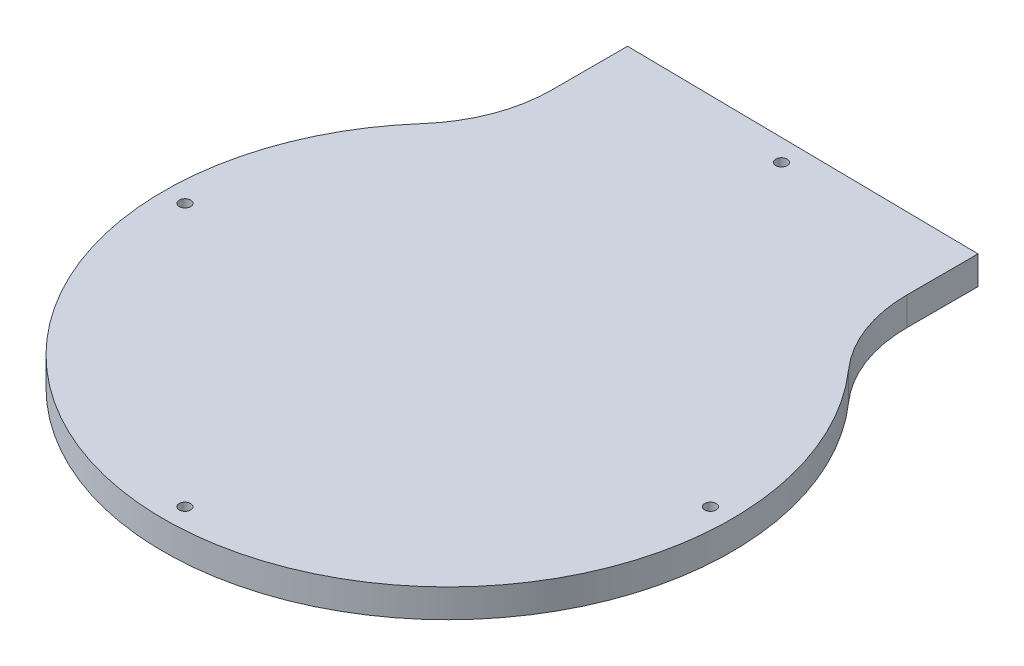
ISO-10303-21;
HEADER;
FILE_DESCRIPTION(('STEP AP214'),'2;1');
FILE_NAME('part.step','',(''),(''),'','','');
FILE_SCHEMA(('AUTOMOTIVE_DESIGN { 1 0 10303 214 1 1 1 1 }'));
ENDSEC;
DATA;
#1=APPLICATION_CONTEXT('core data for automotive mechanical design processes');
#2=APPLICATION_PROTOCOL_DEFINITION('international standard','automotive_design',2000,#1);
#3=PRODUCT_CONTEXT('',#1,'mechanical');
#4=PRODUCT('Part','Part','',(#3));
#5=PRODUCT_RELATED_PRODUCT_CATEGORY('part','',(#4));
#6=PRODUCT_DEFINITION_FORMATION('','',#4);
#7=PRODUCT_DEFINITION_CONTEXT('part definition',#1,'design');
#8=PRODUCT_DEFINITION('design','',#6,#7);
#9=PRODUCT_DEFINITION_SHAPE('','',#8);
#10=(LENGTH_UNIT() NAMED_UNIT(*) SI_UNIT(.MILLI.,.METRE.));
#11=(NAMED_UNIT(*) PLANE_ANGLE_UNIT() SI_UNIT($,.RADIAN.));
#12=(NAMED_UNIT(*) SI_UNIT($,.STERADIAN.) SOLID_ANGLE_UNIT());
#13=UNCERTAINTY_MEASURE_WITH_UNIT(LENGTH_MEASURE(1.E-05),#10,'distance_accuracy_value','');
#14=(GEOMETRIC_REPRESENTATION_CONTEXT(3) GLOBAL_UNCERTAINTY_ASSIGNED_CONTEXT((#13)) GLOBAL_UNIT_ASSIGNED_CONTEXT((#10,
#11,#12)) REPRESENTATION_CONTEXT('',''));
#15=CARTESIAN_POINT('',(0.,0.,0.));
#16=DIRECTION('',(0.,0.,1.));
#17=DIRECTION('',(1.,0.,0.));
#18=AXIS2_PLACEMENT_3D('',#15,#16,#17);
#19=CARTESIAN_POINT('',(44.9979087332291,4.,-39.6886408136634));
#20=DIRECTION('',(0.,-1.,0.));
#21=DIRECTION('',(0.,0.,-1.));
#22=AXIS2_PLACEMENT_3D('',#19,#20,#21);
#23=CYLINDRICAL_SURFACE('',#22,20.);
#24=CARTESIAN_POINT('',(44.9979087332291,0.,-39.6886408136634));
#25=DIRECTION('',(0.,1.,0.));
#26=DIRECTION('',(0.,0.,1.));
#27=AXIS2_PLACEMENT_3D('',#24,#25,#26);
#28=CIRCLE('',#27,20.);
#29=CARTESIAN_POINT('',(24.997908733229,0.,-39.6886408136634));
#30=VERTEX_POINT('',#29);
#31=CARTESIAN_POINT('',(29.9986058221527,0.,-26.4590938757756));
#32=VERTEX_POINT('',#31);
#33=EDGE_CURVE('E118',#30,#32,#28,.T.);
#34=ORIENTED_EDGE('',*,*,#33,.F.);
#35=DIRECTION('',(0.,-1.,0.));
#36=VECTOR('',#35,1.);
#37=CARTESIAN_POINT('',(24.997908733229,4.,-39.6886408136634));
#38=LINE('',#37,#36);
#39=CARTESIAN_POINT('',(24.997908733229,4.,-39.6886408136634));
#40=VERTEX_POINT('',#39);
#41=EDGE_CURVE('E11',#40,#30,#38,.T.);
#42=ORIENTED_EDGE('',*,*,#41,.F.);
#43=CARTESIAN_POINT('',(44.9979087332291,4.,-39.6886408136634));
#44=DIRECTION('',(0.,1.,0.));
#45=DIRECTION('',(0.,0.,1.));
#46=AXIS2_PLACEMENT_3D('',#43,#44,#45);
#47=CIRCLE('',#46,20.);
#48=CARTESIAN_POINT('',(29.9986058221527,4.,-26.4590938757756));
#49=VERTEX_POINT('',#48);
#50=EDGE_CURVE('E133',#40,#49,#47,.T.);
#51=ORIENTED_EDGE('',*,*,#50,.T.);
#52=DIRECTION('',(0.,-1.,0.));
#53=VECTOR('',#52,1.);
#54=CARTESIAN_POINT('',(29.9986058221527,4.,-26.4590938757756));
#55=LINE('',#54,#53);
#56=EDGE_CURVE('E36',#49,#32,#55,.T.);
#57=ORIENTED_EDGE('',*,*,#56,.T.);
#58=EDGE_LOOP('',(#34,#42,#51,#57));
#59=FACE_BOUND('',#58,.T.);
#60=ADVANCED_FACE('F33',(#59),#23,.F.);
#61=CARTESIAN_POINT('',(24.997908733229,4.,-49.680827096187));
#62=DIRECTION('',(1.,0.,0.));
#63=DIRECTION('',(0.,0.,-1.));
#64=AXIS2_PLACEMENT_3D('',#61,#62,#63);
#65=PLANE('',#64);
#66=DIRECTION('',(0.,0.,1.));
#67=VECTOR('',#66,1.);
#68=CARTESIAN_POINT('',(24.997908733229,0.,-49.680827096187));
#69=LINE('',#68,#67);
#70=CARTESIAN_POINT('',(24.997908733229,0.,-49.680827096187));
#71=VERTEX_POINT('',#70);
#72=EDGE_CURVE('E131',#71,#30,#69,.T.);
#73=ORIENTED_EDGE('',*,*,#72,.F.);
#74=DIRECTION('',(0.,-1.,0.));
#75=VECTOR('',#74,1.);
#76=CARTESIAN_POINT('',(24.997908733229,4.,-49.680827096187));
#77=LINE('',#76,#75);
#78=CARTESIAN_POINT('',(24.997908733229,4.,-49.680827096187));
#79=VERTEX_POINT('',#78);
#80=EDGE_CURVE('E42',#79,#71,#77,.T.);
#81=ORIENTED_EDGE('',*,*,#80,.F.);
#82=DIRECTION('',(0.,0.,1.));
#83=VECTOR('',#82,1.);
#84=CARTESIAN_POINT('',(24.997908733229,4.,-49.680827096187));
#85=LINE('',#84,#83);
#86=EDGE_CURVE('E108',#79,#40,#85,.T.);
#87=ORIENTED_EDGE('',*,*,#86,.T.);
#88=ORIENTED_EDGE('',*,*,#41,.T.);
#89=EDGE_LOOP('',(#73,#81,#87,#88));
#90=FACE_BOUND('',#89,.T.);
#91=ADVANCED_FACE('F141',(#90),#65,.T.);
#92=CARTESIAN_POINT('',(-24.997908733229,4.,-50.3275386706989));
#93=DIRECTION('',(0.01293423149024,0.,-0.999916349329161));
#94=DIRECTION('',(-0.999916349329161,0.,-0.01293423149024));
#95=AXIS2_PLACEMENT_3D('',#92,#93,#94);
#96=PLANE('',#95);
#97=DIRECTION('',(0.999916349329161,0.,0.01293423149024));
#98=VECTOR('',#97,1.);
#99=CARTESIAN_POINT('',(-24.997908733229,0.,-50.3275386706989));
#100=LINE('',#99,#98);
#101=CARTESIAN_POINT('',(-24.997908733229,0.,-50.3275386706989));
#102=VERTEX_POINT('',#101);
#103=EDGE_CURVE('E95',#102,#71,#100,.T.);
#104=ORIENTED_EDGE('',*,*,#103,.F.);
#105=DIRECTION('',(0.,-1.,0.));
#106=VECTOR('',#105,1.);
#107=CARTESIAN_POINT('',(-24.997908733229,4.,-50.3275386706989));
#108=LINE('',#107,#106);
#109=CARTESIAN_POINT('',(-24.997908733229,4.,-50.3275386706989));
#110=VERTEX_POINT('',#109);
#111=EDGE_CURVE('E90',#110,#102,#108,.T.);
#112=ORIENTED_EDGE('',*,*,#111,.F.);
#113=DIRECTION('',(0.999916349329161,0.,0.01293423149024));
#114=VECTOR('',#113,1.);
#115=CARTESIAN_POINT('',(-24.997908733229,4.,-50.3275386706989));
#116=LINE('',#115,#114);
#117=EDGE_CURVE('E93',#110,#79,#116,.T.);
#118=ORIENTED_EDGE('',*,*,#117,.T.);
#119=ORIENTED_EDGE('',*,*,#80,.T.);
#120=EDGE_LOOP('',(#104,#112,#118,#119));
#121=FACE_BOUND('',#120,.T.);
#122=ADVANCED_FACE('F92',(#121),#96,.T.);
#123=CARTESIAN_POINT('',(-24.997908733229,4.,-39.6886408136634));
#124=DIRECTION('',(-1.,0.,0.));
#125=DIRECTION('',(0.,0.,1.));
#126=AXIS2_PLACEMENT_3D('',#123,#124,#125);
#127=PLANE('',#126);
#128=DIRECTION('',(0.,0.,-1.));
#129=VECTOR('',#128,1.);
#130=CARTESIAN_POINT('',(-24.997908733229,0.,-39.6886408136634));
#131=LINE('',#130,#129);
#132=CARTESIAN_POINT('',(-24.997908733229,0.,-39.6886408136634));
#133=VERTEX_POINT('',#132);
#134=EDGE_CURVE('E128',#133,#102,#131,.T.);
#135=ORIENTED_EDGE('',*,*,#134,.F.);
#136=DIRECTION('',(0.,-1.,0.));
#137=VECTOR('',#136,1.);
#138=CARTESIAN_POINT('',(-24.997908733229,4.,-39.6886408136634));
#139=LINE('',#138,#137);
#140=CARTESIAN_POINT('',(-24.997908733229,4.,-39.6886408136634));
#141=VERTEX_POINT('',#140);
#142=EDGE_CURVE('E100',#141,#133,#139,.T.);
#143=ORIENTED_EDGE('',*,*,#142,.F.);
#144=DIRECTION('',(0.,0.,-1.));
#145=VECTOR('',#144,1.);
#146=CARTESIAN_POINT('',(-24.997908733229,4.,-39.6886408136634));
#147=LINE('',#146,#145);
#148=EDGE_CURVE('E106',#141,#110,#147,.T.);
#149=ORIENTED_EDGE('',*,*,#148,.T.);
#150=ORIENTED_EDGE('',*,*,#111,.T.);
#151=EDGE_LOOP('',(#135,#143,#149,#150));
#152=FACE_BOUND('',#151,.T.);
#153=ADVANCED_FACE('F110',(#152),#127,.T.);
#154=CARTESIAN_POINT('',(-44.997908733229,4.,-39.6886408136634));
#155=DIRECTION('',(0.,-1.,0.));
#156=DIRECTION('',(0.,0.,-1.));
#157=AXIS2_PLACEMENT_3D('',#154,#155,#156);
#158=CYLINDRICAL_SURFACE('',#157,20.);
#159=CARTESIAN_POINT('',(-44.997908733229,0.,-39.6886408136634));
#160=DIRECTION('',(0.,1.,0.));
#161=DIRECTION('',(0.,0.,1.));
#162=AXIS2_PLACEMENT_3D('',#159,#160,#161);
#163=CIRCLE('',#162,20.);
#164=CARTESIAN_POINT('',(-29.9986058221527,0.,-26.4590938757756));
#165=VERTEX_POINT('',#164);
#166=EDGE_CURVE('E125',#165,#133,#163,.T.);
#167=ORIENTED_EDGE('',*,*,#166,.F.);
#168=DIRECTION('',(0.,-1.,0.));
#169=VECTOR('',#168,1.);
#170=CARTESIAN_POINT('',(-29.9986058221527,4.,-26.4590938757756));
#171=LINE('',#170,#169);
#172=CARTESIAN_POINT('',(-29.9986058221527,4.,-26.4590938757756));
#173=VERTEX_POINT('',#172);
#174=EDGE_CURVE('E136',#173,#165,#171,.T.);
#175=ORIENTED_EDGE('',*,*,#174,.F.);
#176=CARTESIAN_POINT('',(-44.997908733229,4.,-39.6886408136634));
#177=DIRECTION('',(0.,1.,0.));
#178=DIRECTION('',(0.,0.,1.));
#179=AXIS2_PLACEMENT_3D('',#176,#177,#178);
#180=CIRCLE('',#179,20.);
#181=EDGE_CURVE('E111',#173,#141,#180,.T.);
#182=ORIENTED_EDGE('',*,*,#181,.T.);
#183=ORIENTED_EDGE('',*,*,#142,.T.);
#184=EDGE_LOOP('',(#167,#175,#182,#183));
#185=FACE_BOUND('',#184,.T.);
#186=ADVANCED_FACE('F154',(#185),#158,.F.);
#187=CARTESIAN_POINT('',(0.,4.,0.));
#188=DIRECTION('',(0.,-1.,0.));
#189=DIRECTION('',(0.,0.,-1.));
#190=AXIS2_PLACEMENT_3D('',#187,#188,#189);
#191=CYLINDRICAL_SURFACE('',#190,40.);
#192=CARTESIAN_POINT('',(0.,0.,0.));
#193=DIRECTION('',(0.,-1.,0.));
#194=DIRECTION('',(0.,0.,-1.));
#195=AXIS2_PLACEMENT_3D('',#192,#193,#194);
#196=CIRCLE('',#195,40.);
#197=EDGE_CURVE('E121',#32,#165,#196,.T.);
#198=ORIENTED_EDGE('',*,*,#197,.F.);
#199=ORIENTED_EDGE('',*,*,#56,.F.);
#200=CARTESIAN_POINT('',(0.,4.,0.));
#201=DIRECTION('',(0.,-1.,0.));
#202=DIRECTION('',(0.,0.,-1.));
#203=AXIS2_PLACEMENT_3D('',#200,#201,#202);
#204=CIRCLE('',#203,40.);
#205=EDGE_CURVE('E113',#49,#173,#204,.T.);
#206=ORIENTED_EDGE('',*,*,#205,.T.);
#207=ORIENTED_EDGE('',*,*,#174,.T.);
#208=EDGE_LOOP('',(#198,#199,#206,#207));
#209=FACE_BOUND('',#208,.T.);
#210=ADVANCED_FACE('F138',(#209),#191,.T.);
#211=CARTESIAN_POINT('',(44.9979087332291,4.,-39.6886408136634));
#212=DIRECTION('',(0.,1.,0.));
#213=DIRECTION('',(0.,0.,1.));
#214=AXIS2_PLACEMENT_3D('',#211,#212,#213);
#215=PLANE('',#214);
#216=CARTESIAN_POINT('',(0.,4.,-47.0039319104364));
#217=DIRECTION('',(0.,-1.,0.));
#218=DIRECTION('',(0.,0.,1.));
#219=AXIS2_PLACEMENT_3D('',#216,#217,#218);
#220=CIRCLE('',#219,0.799999999999988);
#221=CARTESIAN_POINT('',(0.,4.,-46.2039319104364));
#222=VERTEX_POINT('',#221);
#223=EDGE_CURVE('E188',#222,#222,#220,.T.);
#224=ORIENTED_EDGE('',*,*,#223,.T.);
#225=EDGE_LOOP('',(#224));
#226=FACE_BOUND('',#225,.T.);
#227=CARTESIAN_POINT('',(-37.0000000000002,4.,2.58369619074393E-13));
#228=DIRECTION('',(0.,-1.,0.));
#229=DIRECTION('',(0.,0.,1.));
#230=AXIS2_PLACEMENT_3D('',#227,#228,#229);
#231=CIRCLE('',#230,0.799999999999988);
#232=CARTESIAN_POINT('',(-37.0000000000002,4.,0.800000000000247));
#233=VERTEX_POINT('',#232);
#234=EDGE_CURVE('E196',#233,#233,#231,.T.);
#235=ORIENTED_EDGE('',*,*,#234,.T.);
#236=EDGE_LOOP('',(#235));
#237=FACE_BOUND('',#236,.T.);
#238=CARTESIAN_POINT('',(0.,4.,37.0000000000002));
#239=DIRECTION('',(0.,-1.,0.));
#240=DIRECTION('',(0.,0.,1.));
#241=AXIS2_PLACEMENT_3D('',#238,#239,#240);
#242=CIRCLE('',#241,0.799999999999988);
#243=CARTESIAN_POINT('',(0.,4.,37.8000000000002));
#244=VERTEX_POINT('',#243);
#245=EDGE_CURVE('E202',#244,#244,#242,.T.);
#246=ORIENTED_EDGE('',*,*,#245,.T.);
#247=EDGE_LOOP('',(#246));
#248=FACE_BOUND('',#247,.T.);
#249=CARTESIAN_POINT('',(37.0000000000002,4.,0.));
#250=DIRECTION('',(0.,-1.,0.));
#251=DIRECTION('',(0.,0.,1.));
#252=AXIS2_PLACEMENT_3D('',#249,#250,#251);
#253=CIRCLE('',#252,0.799999999999988);
#254=CARTESIAN_POINT('',(37.0000000000002,4.,0.799999999999988));
#255=VERTEX_POINT('',#254);
#256=EDGE_CURVE('E122',#255,#255,#253,.T.);
#257=ORIENTED_EDGE('',*,*,#256,.T.);
#258=EDGE_LOOP('',(#257));
#259=FACE_BOUND('',#258,.T.);
#260=ORIENTED_EDGE('',*,*,#50,.F.);
#261=ORIENTED_EDGE('',*,*,#86,.F.);
#262=ORIENTED_EDGE('',*,*,#117,.F.);
#263=ORIENTED_EDGE('',*,*,#148,.F.);
#264=ORIENTED_EDGE('',*,*,#181,.F.);
#265=ORIENTED_EDGE('',*,*,#205,.F.);
#266=EDGE_LOOP('',(#260,#261,#262,#263,#264,#265));
#267=FACE_BOUND('',#266,.T.);
#268=ADVANCED_FACE('F104',(#226,#237,#248,#259,#267),#215,.T.);
#269=CARTESIAN_POINT('',(44.9979087332291,0.,-39.6886408136634));
#270=DIRECTION('',(0.,1.,0.));
#271=DIRECTION('',(0.,0.,1.));
#272=AXIS2_PLACEMENT_3D('',#269,#270,#271);
#273=PLANE('',#272);
#274=CARTESIAN_POINT('',(0.,0.,-47.0039319104364));
#275=DIRECTION('',(0.,-1.,0.));
#276=DIRECTION('',(0.,0.,1.));
#277=AXIS2_PLACEMENT_3D('',#274,#275,#276);
#278=CIRCLE('',#277,0.799999999999988);
#279=CARTESIAN_POINT('',(0.,0.,-46.2039319104364));
#280=VERTEX_POINT('',#279);
#281=EDGE_CURVE('E191',#280,#280,#278,.T.);
#282=ORIENTED_EDGE('',*,*,#281,.F.);
#283=EDGE_LOOP('',(#282));
#284=FACE_BOUND('',#283,.T.);
#285=CARTESIAN_POINT('',(-37.0000000000002,0.,2.58369619074393E-13));
#286=DIRECTION('',(0.,-1.,0.));
#287=DIRECTION('',(0.,0.,1.));
#288=AXIS2_PLACEMENT_3D('',#285,#286,#287);
#289=CIRCLE('',#288,0.799999999999988);
#290=CARTESIAN_POINT('',(-37.0000000000002,0.,0.800000000000247));
#291=VERTEX_POINT('',#290);
#292=EDGE_CURVE('E193',#291,#291,#289,.T.);
#293=ORIENTED_EDGE('',*,*,#292,.F.);
#294=EDGE_LOOP('',(#293));
#295=FACE_BOUND('',#294,.T.);
#296=CARTESIAN_POINT('',(0.,0.,37.0000000000002));
#297=DIRECTION('',(0.,-1.,0.));
#298=DIRECTION('',(0.,0.,1.));
#299=AXIS2_PLACEMENT_3D('',#296,#297,#298);
#300=CIRCLE('',#299,0.799999999999988);
#301=CARTESIAN_POINT('',(0.,0.,37.8000000000002));
#302=VERTEX_POINT('',#301);
#303=EDGE_CURVE('E199',#302,#302,#300,.T.);
#304=ORIENTED_EDGE('',*,*,#303,.F.);
#305=EDGE_LOOP('',(#304));
#306=FACE_BOUND('',#305,.T.);
#307=CARTESIAN_POINT('',(37.0000000000002,0.,0.));
#308=DIRECTION('',(0.,-1.,0.));
#309=DIRECTION('',(0.,0.,1.));
#310=AXIS2_PLACEMENT_3D('',#307,#308,#309);
#311=CIRCLE('',#310,0.799999999999988);
#312=CARTESIAN_POINT('',(37.0000000000002,0.,0.799999999999988));
#313=VERTEX_POINT('',#312);
#314=EDGE_CURVE('E205',#313,#313,#311,.T.);
#315=ORIENTED_EDGE('',*,*,#314,.F.);
#316=EDGE_LOOP('',(#315));
#317=FACE_BOUND('',#316,.T.);
#318=ORIENTED_EDGE('',*,*,#33,.T.);
#319=ORIENTED_EDGE('',*,*,#197,.T.);
#320=ORIENTED_EDGE('',*,*,#166,.T.);
#321=ORIENTED_EDGE('',*,*,#134,.T.);
#322=ORIENTED_EDGE('',*,*,#103,.T.);
#323=ORIENTED_EDGE('',*,*,#72,.T.);
#324=EDGE_LOOP('',(#318,#319,#320,#321,#322,#323));
#325=FACE_BOUND('',#324,.T.);
#326=ADVANCED_FACE('F140',(#284,#295,#306,#317,#325),#273,.F.);
#327=CARTESIAN_POINT('',(37.0000000000002,4.,0.));
#328=DIRECTION('',(0.,-1.,0.));
#329=DIRECTION('',(0.,0.,-1.));
#330=AXIS2_PLACEMENT_3D('',#327,#328,#329);
#331=CYLINDRICAL_SURFACE('',#330,0.799999999999988);
#332=ORIENTED_EDGE('',*,*,#256,.F.);
#333=EDGE_LOOP('',(#332));
#334=FACE_BOUND('',#333,.T.);
#335=ORIENTED_EDGE('',*,*,#314,.T.);
#336=EDGE_LOOP('',(#335));
#337=FACE_BOUND('',#336,.T.);
#338=ADVANCED_FACE('F165',(#334,#337),#331,.F.);
#339=CARTESIAN_POINT('',(0.,4.,37.0000000000002));
#340=DIRECTION('',(0.,-1.,0.));
#341=DIRECTION('',(0.,0.,-1.));
#342=AXIS2_PLACEMENT_3D('',#339,#340,#341);
#343=CYLINDRICAL_SURFACE('',#342,0.799999999999988);
#344=ORIENTED_EDGE('',*,*,#245,.F.);
#345=EDGE_LOOP('',(#344));
#346=FACE_BOUND('',#345,.T.);
#347=ORIENTED_EDGE('',*,*,#303,.T.);
#348=EDGE_LOOP('',(#347));
#349=FACE_BOUND('',#348,.T.);
#350=ADVANCED_FACE('F172',(#346,#349),#343,.F.);
#351=CARTESIAN_POINT('',(-37.0000000000002,4.,2.58369619074393E-13));
#352=DIRECTION('',(0.,-1.,0.));
#353=DIRECTION('',(0.,0.,-1.));
#354=AXIS2_PLACEMENT_3D('',#351,#352,#353);
#355=CYLINDRICAL_SURFACE('',#354,0.799999999999988);
#356=ORIENTED_EDGE('',*,*,#234,.F.);
#357=EDGE_LOOP('',(#356));
#358=FACE_BOUND('',#357,.T.);
#359=ORIENTED_EDGE('',*,*,#292,.T.);
#360=EDGE_LOOP('',(#359));
#361=FACE_BOUND('',#360,.T.);
#362=ADVANCED_FACE('F176',(#358,#361),#355,.F.);
#363=CARTESIAN_POINT('',(0.,4.,-47.0039319104364));
#364=DIRECTION('',(0.,-1.,0.));
#365=DIRECTION('',(0.,0.,-1.));
#366=AXIS2_PLACEMENT_3D('',#363,#364,#365);
#367=CYLINDRICAL_SURFACE('',#366,0.799999999999988);
#368=ORIENTED_EDGE('',*,*,#223,.F.);
#369=EDGE_LOOP('',(#368));
#370=FACE_BOUND('',#369,.T.);
#371=ORIENTED_EDGE('',*,*,#281,.T.);
#372=EDGE_LOOP('',(#371));
#373=FACE_BOUND('',#372,.T.);
#374=ADVANCED_FACE('F180',(#370,#373),#367,.F.);
#375=CLOSED_SHELL('',(#60,#91,#122,#153,#186,#210,#268,#326,#338,#350,#362,#374));
#376=MANIFOLD_SOLID_BREP('B2',#375);
#377=ADVANCED_BREP_SHAPE_REPRESENTATION('',(#18,#376),#14);
#378=SHAPE_DEFINITION_REPRESENTATION(#9,#377);
ENDSEC;
END-ISO-10303-21;
